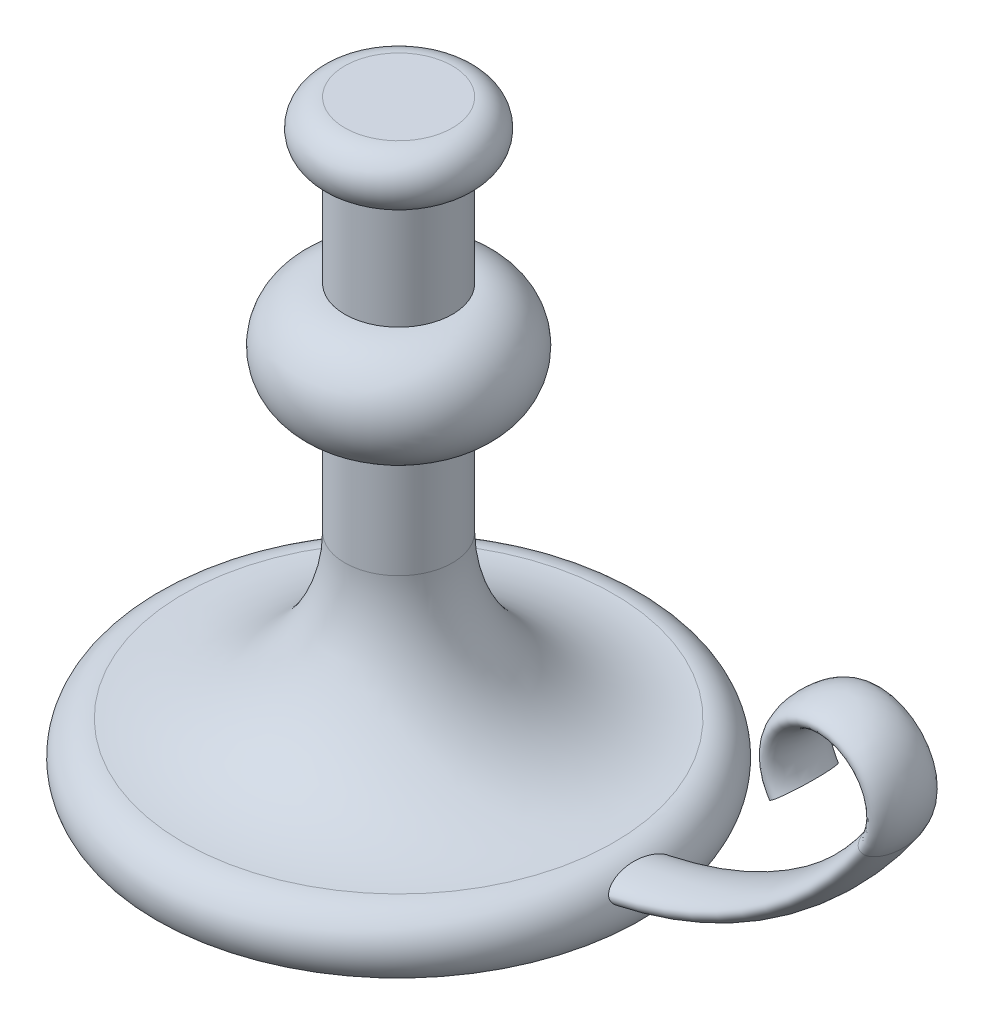
ISO-10303-21;
HEADER;
FILE_DESCRIPTION(('STEP AP214'),'2;1');
FILE_NAME('part.step','',(''),(''),'','','');
FILE_SCHEMA(('AUTOMOTIVE_DESIGN { 1 0 10303 214 1 1 1 1 }'));
ENDSEC;
DATA;
#1=APPLICATION_CONTEXT('core data for automotive mechanical design processes');
#2=APPLICATION_PROTOCOL_DEFINITION('international standard','automotive_design',2000,#1);
#3=PRODUCT_CONTEXT('',#1,'mechanical');
#4=PRODUCT('Part','Part','',(#3));
#5=PRODUCT_RELATED_PRODUCT_CATEGORY('part','',(#4));
#6=PRODUCT_DEFINITION_FORMATION('','',#4);
#7=PRODUCT_DEFINITION_CONTEXT('part definition',#1,'design');
#8=PRODUCT_DEFINITION('design','',#6,#7);
#9=PRODUCT_DEFINITION_SHAPE('','',#8);
#10=(LENGTH_UNIT() NAMED_UNIT(*) SI_UNIT(.MILLI.,.METRE.));
#11=(NAMED_UNIT(*) PLANE_ANGLE_UNIT() SI_UNIT($,.RADIAN.));
#12=(NAMED_UNIT(*) SI_UNIT($,.STERADIAN.) SOLID_ANGLE_UNIT());
#13=UNCERTAINTY_MEASURE_WITH_UNIT(LENGTH_MEASURE(1.E-05),#10,'distance_accuracy_value','');
#14=(GEOMETRIC_REPRESENTATION_CONTEXT(3) GLOBAL_UNCERTAINTY_ASSIGNED_CONTEXT((#13)) GLOBAL_UNIT_ASSIGNED_CONTEXT((#10,
#11,#12)) REPRESENTATION_CONTEXT('',''));
#15=CARTESIAN_POINT('',(0.,0.,0.));
#16=DIRECTION('',(0.,0.,1.));
#17=DIRECTION('',(1.,0.,0.));
#18=AXIS2_PLACEMENT_3D('',#15,#16,#17);
#19=CARTESIAN_POINT('',(0.,0.,0.));
#20=DIRECTION('',(0.,1.,0.));
#21=DIRECTION('',(0.,0.,1.));
#22=AXIS2_PLACEMENT_3D('',#19,#20,#21);
#23=PLANE('',#22);
#24=CARTESIAN_POINT('',(0.,0.,0.));
#25=DIRECTION('',(0.,1.,0.));
#26=DIRECTION('',(0.,0.,1.));
#27=AXIS2_PLACEMENT_3D('',#24,#25,#26);
#28=CIRCLE('',#27,90.);
#29=CARTESIAN_POINT('',(0.,0.,90.));
#30=VERTEX_POINT('',#29);
#31=EDGE_CURVE('E68',#30,#30,#28,.T.);
#32=ORIENTED_EDGE('',*,*,#31,.F.);
#33=EDGE_LOOP('',(#32));
#34=FACE_BOUND('',#33,.T.);
#35=ADVANCED_FACE('F38',(#34),#23,.F.);
#36=CARTESIAN_POINT('',(0.,220.,0.));
#37=DIRECTION('',(0.,-1.,0.));
#38=DIRECTION('',(0.,0.,-1.));
#39=AXIS2_PLACEMENT_3D('',#36,#37,#38);
#40=PLANE('',#39);
#41=CARTESIAN_POINT('',(0.,220.,0.));
#42=DIRECTION('',(0.,1.,0.));
#43=DIRECTION('',(0.,0.,1.));
#44=AXIS2_PLACEMENT_3D('',#41,#42,#43);
#45=CIRCLE('',#44,20.);
#46=CARTESIAN_POINT('',(0.,220.,20.));
#47=VERTEX_POINT('',#46);
#48=EDGE_CURVE('E10',#47,#47,#45,.T.);
#49=ORIENTED_EDGE('',*,*,#48,.T.);
#50=EDGE_LOOP('',(#49));
#51=FACE_BOUND('',#50,.T.);
#52=ADVANCED_FACE('F110',(#51),#40,.F.);
#53=CARTESIAN_POINT('',(0.,210.,0.));
#54=DIRECTION('',(0.,1.,0.));
#55=DIRECTION('',(0.,0.,1.));
#56=AXIS2_PLACEMENT_3D('',#53,#54,#55);
#57=TOROIDAL_SURFACE('',#56,20.,10.);
#58=ORIENTED_EDGE('',*,*,#48,.F.);
#59=EDGE_LOOP('',(#58));
#60=FACE_BOUND('',#59,.T.);
#61=CARTESIAN_POINT('',(0.,200.,0.));
#62=DIRECTION('',(0.,1.,0.));
#63=DIRECTION('',(0.,0.,1.));
#64=AXIS2_PLACEMENT_3D('',#61,#62,#63);
#65=CIRCLE('',#64,20.);
#66=CARTESIAN_POINT('',(0.,200.,20.));
#67=VERTEX_POINT('',#66);
#68=EDGE_CURVE('E50',#67,#67,#65,.T.);
#69=ORIENTED_EDGE('',*,*,#68,.T.);
#70=EDGE_LOOP('',(#69));
#71=FACE_BOUND('',#70,.T.);
#72=ADVANCED_FACE('F107',(#60,#71),#57,.T.);
#73=CARTESIAN_POINT('',(0.,301.66189863104,0.));
#74=DIRECTION('',(0.,1.,0.));
#75=DIRECTION('',(0.,0.,1.));
#76=AXIS2_PLACEMENT_3D('',#73,#74,#75);
#77=CYLINDRICAL_SURFACE('',#76,20.);
#78=ORIENTED_EDGE('',*,*,#68,.F.);
#79=EDGE_LOOP('',(#78));
#80=FACE_BOUND('',#79,.T.);
#81=CARTESIAN_POINT('',(0.,160.,0.));
#82=DIRECTION('',(0.,1.,0.));
#83=DIRECTION('',(0.,0.,1.));
#84=AXIS2_PLACEMENT_3D('',#81,#82,#83);
#85=CIRCLE('',#84,20.);
#86=CARTESIAN_POINT('',(0.,160.,20.));
#87=VERTEX_POINT('',#86);
#88=EDGE_CURVE('E54',#87,#87,#85,.T.);
#89=ORIENTED_EDGE('',*,*,#88,.T.);
#90=EDGE_LOOP('',(#89));
#91=FACE_BOUND('',#90,.T.);
#92=ADVANCED_FACE('F103',(#80,#91),#77,.T.);
#93=CARTESIAN_POINT('',(0.,140.,0.));
#94=DIRECTION('',(0.,1.,0.));
#95=DIRECTION('',(0.,0.,1.));
#96=AXIS2_PLACEMENT_3D('',#93,#94,#95);
#97=DEGENERATE_TOROIDAL_SURFACE('',#96,19.9999999999999,20.,.T.);
#98=ORIENTED_EDGE('',*,*,#88,.F.);
#99=EDGE_LOOP('',(#98));
#100=FACE_BOUND('',#99,.T.);
#101=CARTESIAN_POINT('',(0.,120.,0.));
#102=DIRECTION('',(0.,1.,0.));
#103=DIRECTION('',(0.,0.,1.));
#104=AXIS2_PLACEMENT_3D('',#101,#102,#103);
#105=CIRCLE('',#104,20.);
#106=CARTESIAN_POINT('',(0.,120.,20.));
#107=VERTEX_POINT('',#106);
#108=EDGE_CURVE('E59',#107,#107,#105,.T.);
#109=ORIENTED_EDGE('',*,*,#108,.T.);
#110=EDGE_LOOP('',(#109));
#111=FACE_BOUND('',#110,.T.);
#112=ADVANCED_FACE('F99',(#100,#111),#97,.T.);
#113=CARTESIAN_POINT('',(0.,301.66189863104,0.));
#114=DIRECTION('',(0.,1.,0.));
#115=DIRECTION('',(0.,0.,1.));
#116=AXIS2_PLACEMENT_3D('',#113,#114,#115);
#117=CYLINDRICAL_SURFACE('',#116,20.);
#118=ORIENTED_EDGE('',*,*,#108,.F.);
#119=EDGE_LOOP('',(#118));
#120=FACE_BOUND('',#119,.T.);
#121=CARTESIAN_POINT('',(0.,80.,0.));
#122=DIRECTION('',(0.,1.,0.));
#123=DIRECTION('',(0.,0.,1.));
#124=AXIS2_PLACEMENT_3D('',#121,#122,#123);
#125=CIRCLE('',#124,20.);
#126=CARTESIAN_POINT('',(0.,80.,20.));
#127=VERTEX_POINT('',#126);
#128=EDGE_CURVE('E62',#127,#127,#125,.T.);
#129=ORIENTED_EDGE('',*,*,#128,.T.);
#130=EDGE_LOOP('',(#129));
#131=FACE_BOUND('',#130,.T.);
#132=ADVANCED_FACE('F95',(#120,#131),#117,.T.);
#133=CARTESIAN_POINT('',(0.,80.,0.));
#134=DIRECTION('',(0.,1.,0.));
#135=DIRECTION('',(0.,0.,1.));
#136=AXIS2_PLACEMENT_3D('',#133,#134,#135);
#137=TOROIDAL_SURFACE('',#136,80.,60.);
#138=ORIENTED_EDGE('',*,*,#128,.F.);
#139=EDGE_LOOP('',(#138));
#140=FACE_BOUND('',#139,.T.);
#141=CARTESIAN_POINT('',(0.,20.,0.));
#142=DIRECTION('',(0.,1.,0.));
#143=DIRECTION('',(0.,0.,1.));
#144=AXIS2_PLACEMENT_3D('',#141,#142,#143);
#145=CIRCLE('',#144,80.0000000000002);
#146=CARTESIAN_POINT('',(0.,20.,80.0000000000002));
#147=VERTEX_POINT('',#146);
#148=EDGE_CURVE('E65',#147,#147,#145,.T.);
#149=ORIENTED_EDGE('',*,*,#148,.T.);
#150=EDGE_LOOP('',(#149));
#151=FACE_BOUND('',#150,.T.);
#152=ADVANCED_FACE('F91',(#140,#151),#137,.F.);
#153=CARTESIAN_POINT('',(0.,7.50000000000012,0.));
#154=DIRECTION('',(0.,1.,0.));
#155=DIRECTION('',(0.,0.,1.));
#156=AXIS2_PLACEMENT_3D('',#153,#154,#155);
#157=TOROIDAL_SURFACE('',#156,80.0000000000003,12.4999999999998);
#158=CARTESIAN_POINT('',(90.3650444247262,13.1056022951032,-12.1079986496694));
#159=CARTESIAN_POINT('',(90.3953344171669,13.0457657519692,-12.1079995788173));
#160=CARTESIAN_POINT('',(90.4254626602507,12.9858534342584,-12.1049478468171));
#161=CARTESIAN_POINT('',(90.4851825101059,12.8663516968071,-12.0928019828299));
#162=CARTESIAN_POINT('',(90.5147739485849,12.8067623823002,-12.0837059884374));
#163=CARTESIAN_POINT('',(90.57322301634,12.6883672231043,-12.0596890480769));
#164=CARTESIAN_POINT('',(90.6020802235625,12.6295618378862,-12.0447648290361));
#165=CARTESIAN_POINT('',(90.6588877567621,12.5131608281586,-12.0094532635097));
#166=CARTESIAN_POINT('',(90.6868378623216,12.455565498863,-11.9890646001929));
#167=CARTESIAN_POINT('',(90.7480820562558,12.3287155237725,-11.9379573212085));
#168=CARTESIAN_POINT('',(90.7811118454679,12.2598553678122,-11.9059395883533));
#169=CARTESIAN_POINT('',(90.8454973270755,12.1248557318381,-11.8352208891889));
#170=CARTESIAN_POINT('',(90.8768524900891,12.0587171136542,-11.7965178256972));
#171=CARTESIAN_POINT('',(90.9684370887323,11.8645335876216,-11.6716571479163));
#172=CARTESIAN_POINT('',(91.0261317640847,11.7408330471781,-11.5767957594499));
#173=CARTESIAN_POINT('',(91.1244088374528,11.5283714614446,-11.3906180566152));
#174=CARTESIAN_POINT('',(91.1661356204261,11.4374976407012,-11.3022092791319));
#175=CARTESIAN_POINT('',(91.2458693467372,11.2628410319498,-11.1170011632907));
#176=CARTESIAN_POINT('',(91.2838738206914,11.1790629561833,-11.0201963341931));
#177=CARTESIAN_POINT('',(91.3565997193174,11.0179359828742,-10.8199651058589));
#178=CARTESIAN_POINT('',(91.3913150643291,10.9405990218702,-10.7165270151956));
#179=CARTESIAN_POINT('',(91.457791612457,10.7918534117394,-10.5045293060962));
#180=CARTESIAN_POINT('',(91.4895516463404,10.7204471101956,-10.3959676859849));
#181=CARTESIAN_POINT('',(91.5506443575102,10.5825594446186,-10.1740598818109));
#182=CARTESIAN_POINT('',(91.5799594527219,10.5161140626667,-10.0606866395011));
#183=CARTESIAN_POINT('',(91.6362121339164,10.3881708279361,-9.83064816329137));
#184=CARTESIAN_POINT('',(91.6631500172368,10.3266723564916,-9.71398334351211));
#185=CARTESIAN_POINT('',(91.7408376909059,10.1487729935974,-9.35973365417152));
#186=CARTESIAN_POINT('',(91.7884141779778,10.0390753502167,-9.11807055089118));
#187=CARTESIAN_POINT('',(91.8767110243899,9.83452956016785,-8.62691299053791));
#188=CARTESIAN_POINT('',(91.9174182772854,9.73970982407319,-8.37740461667601));
#189=CARTESIAN_POINT('',(91.9929636571146,9.56305841174276,-7.87308702539998));
#190=CARTESIAN_POINT('',(92.0278037628512,9.48122235706377,-7.61827962788448));
#191=CARTESIAN_POINT('',(92.0837292155593,9.34943697643978,-7.17383117050763));
#192=CARTESIAN_POINT('',(92.10599254594,9.2968342482944,-6.98511262719887));
#193=CARTESIAN_POINT('',(92.1480587759864,9.19723277209145,-6.60592503585411));
#194=CARTESIAN_POINT('',(92.1678615408666,9.15023433103273,-6.41545589253651));
#195=CARTESIAN_POINT('',(92.2239133357581,9.01696496184984,-5.84160438785753));
#196=CARTESIAN_POINT('',(92.256771267833,8.93850174227734,-5.45605891308571));
#197=CARTESIAN_POINT('',(92.3146229253613,8.80000704338306,-4.68099254082324));
#198=CARTESIAN_POINT('',(92.3396133332789,8.73998333979584,-4.29147003760654));
#199=CARTESIAN_POINT('',(92.3825441024452,8.63668468503415,-3.50873674607181));
#200=CARTESIAN_POINT('',(92.400464702885,8.59345668453115,-3.11551872137659));
#201=CARTESIAN_POINT('',(92.4296584093647,8.5229570781298,-2.32763386681612));
#202=CARTESIAN_POINT('',(92.4409350060091,8.49567709357484,-1.93296790752996));
#203=CARTESIAN_POINT('',(92.4571533429001,8.45642288131329,-1.14282443002059));
#204=CARTESIAN_POINT('',(92.4620961900525,8.44444597919368,-0.747347065704524));
#205=CARTESIAN_POINT('',(92.4660013982228,8.43498499010465,0.0914159641724225));
#206=CARTESIAN_POINT('',(92.4641725547914,8.43941824943112,0.534728140301492));
#207=CARTESIAN_POINT('',(92.4526726744277,8.46726938960641,1.42078457645396));
#208=CARTESIAN_POINT('',(92.4429994233949,8.49069263041707,1.8635286407844));
#209=CARTESIAN_POINT('',(92.4154789186617,8.55721428556864,2.74762928905702));
#210=CARTESIAN_POINT('',(92.3976254777203,8.60032759278337,3.18898456768507));
#211=CARTESIAN_POINT('',(92.3531728832317,8.70739235783748,4.067761245367));
#212=CARTESIAN_POINT('',(92.3265937679934,8.77129606800371,4.50518932047296));
#213=CARTESIAN_POINT('',(92.2793960719973,8.88435497695634,5.15766844970777));
#214=CARTESIAN_POINT('',(92.2624467370552,8.92489721730413,5.37450160908864));
#215=CARTESIAN_POINT('',(92.2259185126876,9.0120956517451,5.80670673311153));
#216=CARTESIAN_POINT('',(92.2063398090096,9.05875141395259,6.02207879984212));
#217=CARTESIAN_POINT('',(92.1643537088004,9.15857098825636,6.45077860794111));
#218=CARTESIAN_POINT('',(92.1419495479037,9.21172735396666,6.66410839208792));
#219=CARTESIAN_POINT('',(92.0940156331485,9.32514898115348,7.08849895478747));
#220=CARTESIAN_POINT('',(92.0684861820624,9.38541355397956,7.29955995098452));
#221=CARTESIAN_POINT('',(92.0088476345032,9.5257563203962,7.75805387977868));
#222=CARTESIAN_POINT('',(91.9740267963342,9.60743251524525,8.00491162092463));
#223=CARTESIAN_POINT('',(91.8986918230666,9.78334343215815,8.49335896277465));
#224=CARTESIAN_POINT('',(91.8581756492878,9.87758265060666,8.73494664109807));
#225=CARTESIAN_POINT('',(91.7706020857297,10.080162756533,9.20963023167931));
#226=CARTESIAN_POINT('',(91.7235774223356,10.1884329292661,9.44276168919828));
#227=CARTESIAN_POINT('',(91.6469615571581,10.363637275861,9.78439605698211));
#228=CARTESIAN_POINT('',(91.6204199802123,10.424148856822,9.89689300609147));
#229=CARTESIAN_POINT('',(91.5650662843821,10.5498816416798,10.1186378018445));
#230=CARTESIAN_POINT('',(91.5362546798546,10.6151017784043,10.2278863768415));
#231=CARTESIAN_POINT('',(91.4835605162242,10.7338871266828,10.415741450389));
#232=CARTESIAN_POINT('',(91.4602321906687,10.7863212739676,10.4952163613179));
#233=CARTESIAN_POINT('',(91.4120070107176,10.8943429950818,10.6514777225461));
#234=CARTESIAN_POINT('',(91.3871102335156,10.9499304137054,10.7282643048663));
#235=CARTESIAN_POINT('',(91.3097420838669,11.1220254046875,10.9541771280331));
#236=CARTESIAN_POINT('',(91.2546521544413,11.2437316810257,11.0986398846702));
#237=CARTESIAN_POINT('',(91.1655460266923,11.4387050366538,11.302248235214));
#238=CARTESIAN_POINT('',(91.1345601157168,11.5062072887145,11.3682919284131));
#239=CARTESIAN_POINT('',(91.0703051272302,11.6454440996743,11.4946379847645));
#240=CARTESIAN_POINT('',(91.0370357085127,11.717179290842,11.5549394866792));
#241=CARTESIAN_POINT('',(90.9681842881204,11.864756740295,11.668381945738));
#242=CARTESIAN_POINT('',(90.9326086005183,11.9405876974583,11.721541323128));
#243=CARTESIAN_POINT('',(90.8590202289154,12.0964055336403,11.819405719182));
#244=CARTESIAN_POINT('',(90.8210090876389,12.1763897758138,11.8641160203381));
#245=CARTESIAN_POINT('',(90.7558672385255,12.3124519851983,11.9301038965668));
#246=CARTESIAN_POINT('',(90.7293941791075,12.3674874356814,11.9541971937069));
#247=CARTESIAN_POINT('',(90.675487030912,12.4789736042525,11.9975282506438));
#248=CARTESIAN_POINT('',(90.6480532346754,12.5354238900649,12.0167674740981));
#249=CARTESIAN_POINT('',(90.5923531613198,12.6494020484933,12.0499698374865));
#250=CARTESIAN_POINT('',(90.5640875590654,12.7069290344741,12.0639371340187));
#251=CARTESIAN_POINT('',(90.5068569448211,12.8227223822476,12.0862919723968));
#252=CARTESIAN_POINT('',(90.4778919199541,12.8809887576439,12.0946794114304));
#253=CARTESIAN_POINT('',(90.4193499643288,12.9980242872026,12.1056934456909));
#254=CARTESIAN_POINT('',(90.3897712121183,13.0567944949817,12.1082992799972));
#255=CARTESIAN_POINT('',(90.3303210289002,13.1741508477916,12.1076427991656));
#256=CARTESIAN_POINT('',(90.3004496042253,13.2327369967692,12.1043806107201));
#257=CARTESIAN_POINT('',(90.2406235235119,13.3492846430995,12.092101874123));
#258=CARTESIAN_POINT('',(90.2106688402273,13.4072458953822,12.0830831462952));
#259=CARTESIAN_POINT('',(90.1508824839697,13.522132053988,12.0595470605303));
#260=CARTESIAN_POINT('',(90.1210508798935,13.5790564283417,12.0450269590134));
#261=CARTESIAN_POINT('',(90.0560149799231,13.7022821170085,12.0075803012666));
#262=CARTESIAN_POINT('',(90.0208758710302,13.7682914360998,11.9835763629931));
#263=CARTESIAN_POINT('',(89.9512692953021,13.8979366829204,11.9290224531506));
#264=CARTESIAN_POINT('',(89.9168022962232,13.9615709840575,11.8984680885546));
#265=CARTESIAN_POINT('',(89.814604205069,14.1486290191413,11.7980977570117));
#266=CARTESIAN_POINT('',(89.748114798445,14.2681345250593,11.7195983150617));
#267=CARTESIAN_POINT('',(89.6333866860407,14.4708748698143,11.5646542502756));
#268=CARTESIAN_POINT('',(89.5843482154891,14.556309186604,11.4915489692098));
#269=CARTESIAN_POINT('',(89.4886502982518,14.7208496158944,11.337026833065));
#270=CARTESIAN_POINT('',(89.4419923063616,14.7999518750577,11.2556049845495));
#271=CARTESIAN_POINT('',(89.3509275782681,14.952342400007,11.0860830623767));
#272=CARTESIAN_POINT('',(89.3065249040642,15.0256203009916,10.997971605708));
#273=CARTESIAN_POINT('',(89.2198918583549,15.1667703556148,10.8164724641223));
#274=CARTESIAN_POINT('',(89.1776623466245,15.2346403754517,10.7230827211385));
#275=CARTESIAN_POINT('',(89.0963298298502,15.363721472871,10.5345785263535));
#276=CARTESIAN_POINT('',(89.0571737847018,15.425060813162,10.4395741979027));
#277=CARTESIAN_POINT('',(88.9806613053931,15.5434883575107,10.2462383689441));
#278=CARTESIAN_POINT('',(88.9433052335959,15.6005757068273,10.1479062052172));
#279=CARTESIAN_POINT('',(88.8337129879983,15.7661008034035,9.84865088895127));
#280=CARTESIAN_POINT('',(88.7639980191329,15.8687302554138,9.64357575844498));
#281=CARTESIAN_POINT('',(88.6304324348252,16.0611268129956,9.22518235667301));
#282=CARTESIAN_POINT('',(88.5665946441642,16.1508660185511,9.01184743709097));
#283=CARTESIAN_POINT('',(88.4444243628581,16.3190890735384,8.57936326694252));
#284=CARTESIAN_POINT('',(88.3860902585219,16.3975762256216,8.36021574493634));
#285=CARTESIAN_POINT('',(88.2519227876466,16.5746223463471,7.82764744990445));
#286=CARTESIAN_POINT('',(88.1785805949314,16.6684217435906,7.51202001193525));
#287=CARTESIAN_POINT('',(88.0413606563265,16.8397367568042,6.87414060895361));
#288=CARTESIAN_POINT('',(87.9774909048788,16.9172386409778,6.55188330677682));
#289=CARTESIAN_POINT('',(87.8590199499687,17.057967134407,5.90248305832664));
#290=CARTESIAN_POINT('',(87.8044221269076,17.1211885399828,5.57533837728173));
#291=CARTESIAN_POINT('',(87.7044082625477,17.2349162814632,4.91692086181997));
#292=CARTESIAN_POINT('',(87.6590072016961,17.2854019045664,4.58564221059579));
#293=CARTESIAN_POINT('',(87.5776048935869,17.3745985350374,3.92052191018861));
#294=CARTESIAN_POINT('',(87.5415993053733,17.4133149814436,3.58668151825246));
#295=CARTESIAN_POINT('',(87.4791061895073,17.4797711778855,2.91707404522573));
#296=CARTESIAN_POINT('',(87.4526178444351,17.5075118706305,2.58130713211862));
#297=CARTESIAN_POINT('',(87.3951402034084,17.5673090686814,1.68831804232272));
#298=CARTESIAN_POINT('',(87.372540809711,17.5903186980934,1.12990615056647));
#299=CARTESIAN_POINT('',(87.3542356331596,17.6089912846746,0.0120839961518292));
#300=CARTESIAN_POINT('',(87.3585371031343,17.6046468668288,-0.547326495096989));
#301=CARTESIAN_POINT('',(87.3939033025892,17.5684292654337,-1.66270467711561));
#302=CARTESIAN_POINT('',(87.4248856718045,17.5366407971321,-2.2186776649227));
#303=CARTESIAN_POINT('',(87.512929918595,17.4440879604064,-3.32592027180633));
#304=CARTESIAN_POINT('',(87.5699803779017,17.3833362778598,-3.87719184260242));
#305=CARTESIAN_POINT('',(87.6993202466225,17.2407734672704,-4.89228122925859));
#306=CARTESIAN_POINT('',(87.7681778489437,17.1633208498267,-5.35713748235291));
#307=CARTESIAN_POINT('',(87.8853430505043,17.0267643566158,-6.04854632423782));
#308=CARTESIAN_POINT('',(87.9267668872139,16.9777811846037,-6.27829741667951));
#309=CARTESIAN_POINT('',(88.014285999708,16.8723854452851,-6.73520551342333));
#310=CARTESIAN_POINT('',(88.0603813038783,16.8159728328334,-6.96236250195321));
#311=CARTESIAN_POINT('',(88.1669068956986,16.6830162244954,-7.45798529698968));
#312=CARTESIAN_POINT('',(88.2283711685039,16.6046962646467,-7.72575945700067));
#313=CARTESIAN_POINT('',(88.3584907196563,16.4345565719894,-8.25537061683916));
#314=CARTESIAN_POINT('',(88.4271491247875,16.3427309621657,-8.51720497440428));
#315=CARTESIAN_POINT('',(88.5719517937667,16.1436232819347,-9.03173594475365));
#316=CARTESIAN_POINT('',(88.6480666922015,16.0364011262264,-9.2844634355374));
#317=CARTESIAN_POINT('',(88.7686420010514,15.8614598878687,-9.6546437933089));
#318=CARTESIAN_POINT('',(88.8098848350657,15.8008193225108,-9.77650957180563));
#319=CARTESIAN_POINT('',(88.8946739457811,15.6743027305787,-10.0166566638274));
#320=CARTESIAN_POINT('',(88.9382196441416,15.6084280164382,-10.1349388657037));
#321=CARTESIAN_POINT('',(89.0164019511503,15.4883533955946,-10.3375494753595));
#322=CARTESIAN_POINT('',(89.0504859172075,15.4354482139187,-10.4228588666026));
#323=CARTESIAN_POINT('',(89.1201271832631,15.3261111718738,-10.5905737832693));
#324=CARTESIAN_POINT('',(89.1556844193265,15.2696794644903,-10.6729794344186));
#325=CARTESIAN_POINT('',(89.2284300470014,15.1528787939089,-10.8344642153458));
#326=CARTESIAN_POINT('',(89.2656211638283,15.0925031639953,-10.913537320288));
#327=CARTESIAN_POINT('',(89.3416744555685,14.96756972961,-11.0674874529981));
#328=CARTESIAN_POINT('',(89.3805366541905,14.9030118657957,-11.142364421198));
#329=CARTESIAN_POINT('',(89.460535547879,14.768512688018,-11.2879488034745));
#330=CARTESIAN_POINT('',(89.5016952002209,14.6985124268225,-11.3585895691478));
#331=CARTESIAN_POINT('',(89.5858900777333,14.5535488094372,-11.4934443824495));
#332=CARTESIAN_POINT('',(89.62892560491,14.47858465307,-11.5576573897156));
#333=CARTESIAN_POINT('',(89.7167493231271,14.323696483143,-11.6779943656169));
#334=CARTESIAN_POINT('',(89.7615327481851,14.2437856503165,-11.734138610057));
#335=CARTESIAN_POINT('',(89.8528179851754,14.0788733169035,-11.8367234792912));
#336=CARTESIAN_POINT('',(89.8993186835969,13.9938750936225,-11.8831702664509));
#337=CARTESIAN_POINT('',(89.9805967429387,13.843488642917,-11.9530998803335));
#338=CARTESIAN_POINT('',(90.0150402205992,13.7792162957571,-11.9793772541334));
#339=CARTESIAN_POINT('',(90.0844550641861,13.6485717926748,-12.0251042068496));
#340=CARTESIAN_POINT('',(90.1194262139317,13.582200485079,-12.0445565067288));
#341=CARTESIAN_POINT('',(90.1895738474772,13.4479542672364,-12.0759614803794));
#342=CARTESIAN_POINT('',(90.2247498627777,13.3800822024917,-12.0879272657268));
#343=CARTESIAN_POINT('',(90.2950369503777,13.2433742922884,-12.1039447706516));
#344=CARTESIAN_POINT('',(90.3301480309489,13.1745385807611,-12.1079975792199));
#345=CARTESIAN_POINT('',(90.3650444247262,13.1056022951032,-12.1079986496694));
#346=B_SPLINE_CURVE_WITH_KNOTS('',3,(#158,#159,#160,#161,#162,#163,#164,#165,#166,#167,#168,
#169,#170,#171,#172,#173,#174,#175,#176,#177,#178,#179,#180,#181,#182,#183,#184,#185,#186,#187,
#188,#189,#190,#191,#192,#193,#194,#195,#196,#197,#198,#199,#200,#201,#202,#203,#204,#205,#206,
#207,#208,#209,#210,#211,#212,#213,#214,#215,#216,#217,#218,#219,#220,#221,#222,#223,#224,#225,
#226,#227,#228,#229,#230,#231,#232,#233,#234,#235,#236,#237,#238,#239,#240,#241,#242,#243,#244,
#245,#246,#247,#248,#249,#250,#251,#252,#253,#254,#255,#256,#257,#258,#259,#260,#261,#262,#263,
#264,#265,#266,#267,#268,#269,#270,#271,#272,#273,#274,#275,#276,#277,#278,#279,#280,#281,#282,
#283,#284,#285,#286,#287,#288,#289,#290,#291,#292,#293,#294,#295,#296,#297,#298,#299,#300,#301,
#302,#303,#304,#305,#306,#307,#308,#309,#310,#311,#312,#313,#314,#315,#316,#317,#318,#319,#320,
#321,#322,#323,#324,#325,#326,#327,#328,#329,#330,#331,#332,#333,#334,#335,#336,#337,#338,#339,
#340,#341,#342,#343,#344,#345),.UNSPECIFIED.,.T.,.F.,(4,2,2,2,2,2,2,2,2,2,2,2,2,2,2,2,2,2,2,2,2,
2,2,2,2,2,2,2,2,2,2,2,2,2,2,2,2,2,2,2,2,2,2,2,2,2,2,2,2,2,2,2,2,2,2,2,2,2,2,2,2,2,2,2,2,2,2,2,2,
2,2,2,2,2,2,2,2,2,2,2,2,2,2,2,2,2,2,2,2,2,2,2,2,4),(0.,0.201120332346898,0.402302664217558,
0.603598140934941,0.804942169866759,1.05299053144795,1.30111684737405,1.7977639363531,
2.19768783276865,2.59787526716019,2.99878854226505,3.39985976532791,3.80360312797351,
4.20729591929676,5.01531610739935,5.82486097481205,6.63413225918094,7.22555053317948,
7.81700118978162,9.00078495964926,10.1850672346368,11.3726366322333,12.5595815509531,
13.7463190071988,15.0758571678073,16.4057707240316,17.7366918502793,19.0645776810555,
19.728215789868,20.3918070416564,21.0546451528671,21.7174191003025,22.50407182564,
23.2910068586068,24.0741197589807,24.4654066899495,24.8566052142946,25.1505942411406,
25.4445688102059,26.0332996901619,26.3312542793765,26.6292534868994,26.9264687338742,
27.2234975380301,27.4202773490641,27.6169977536232,27.8135627303366,28.0101313287768,
28.2074046424674,28.4046736970114,28.602017490541,28.7994598308452,29.0347145139048,
29.2701274662487,29.7412090373159,30.1087683233587,30.4765496114446,30.8449713803022,
31.2135378057378,31.5724016770988,31.93133749415,32.649616319441,33.3694271091965,
34.0890261888896,35.1003075920516,36.1124376864552,37.12493599925,38.1390705209991,
39.1527356529283,40.1663137020756,41.8429074507769,43.5199532508122,45.1918407221838,
46.8629965792637,48.290644209038,49.0061149730076,49.7215900847505,50.5782176324439,
51.4352190525778,52.2889716032258,52.715538989687,53.1419997522522,53.4599410465857,
53.7778685577665,54.0963481362155,54.4148322346199,54.7374456863963,55.0601112704986,
55.3819513008667,55.7035861874363,55.9358245346936,56.1679701896375,56.3997081276326,
56.6314141713999),.UNSPECIFIED.);
#347=CARTESIAN_POINT('',(90.3650444247262,13.1056022951032,-12.1079986496694));
#348=VERTEX_POINT('',#347);
#349=EDGE_CURVE('E41',#348,#348,#346,.T.);
#350=ORIENTED_EDGE('',*,*,#349,.T.);
#351=EDGE_LOOP('',(#350));
#352=FACE_BOUND('',#351,.T.);
#353=ORIENTED_EDGE('',*,*,#148,.F.);
#354=EDGE_LOOP('',(#353));
#355=FACE_BOUND('',#354,.T.);
#356=ORIENTED_EDGE('',*,*,#31,.T.);
#357=EDGE_LOOP('',(#356));
#358=FACE_BOUND('',#357,.T.);
#359=ADVANCED_FACE('F87',(#352,#355,#358),#157,.T.);
#360=CARTESIAN_POINT('',(60.,10.,0.));
#361=DIRECTION('',(1.,0.,0.));
#362=DIRECTION('',(0.,0.,-1.));
#363=AXIS2_PLACEMENT_3D('',#360,#361,#362);
#364=ELLIPSE('',#363,12.1079986496694,5.);
#365=CARTESIAN_POINT('',(60.,160.,0.));
#366=DIRECTION('',(0.,0.,1.));
#367=AXIS1_PLACEMENT('',#365,#366);
#368=SURFACE_OF_REVOLUTION('',#364,#367);
#369=CARTESIAN_POINT('',(183.592070943083,75.,0.));
#370=DIRECTION('',(0.566666666666667,0.823947139620551,0.));
#371=DIRECTION('',(0.,0.,-1.));
#372=AXIS2_PLACEMENT_3D('',#369,#370,#371);
#373=ELLIPSE('',#372,12.1079986496694,5.);
#374=CARTESIAN_POINT('',(183.592070943083,75.,-12.1079986496694));
#375=VERTEX_POINT('',#374);
#376=EDGE_CURVE('E74',#375,#375,#373,.T.);
#377=ORIENTED_EDGE('',*,*,#376,.F.);
#378=EDGE_LOOP('',(#377));
#379=FACE_BOUND('',#378,.T.);
#380=ORIENTED_EDGE('',*,*,#349,.F.);
#381=EDGE_LOOP('',(#380));
#382=FACE_BOUND('',#381,.T.);
#383=ADVANCED_FACE('F83',(#379,#382),#368,.F.);
#384=CARTESIAN_POINT('',(167.113128150672,86.3333333333333,0.));
#385=DIRECTION('',(0.,0.,1.));
#386=AXIS1_PLACEMENT('',#384,#385);
#387=SURFACE_OF_REVOLUTION('',#373,#386);
#388=ORIENTED_EDGE('',*,*,#376,.T.);
#389=EDGE_LOOP('',(#388));
#390=FACE_BOUND('',#389,.T.);
#391=CARTESIAN_POINT('',(150.634185358261,74.9999999999998,0.));
#392=DIRECTION('',(0.566666666666681,-0.823947139620542,0.));
#393=DIRECTION('',(0.,0.,-1.));
#394=AXIS2_PLACEMENT_3D('',#391,#392,#393);
#395=ELLIPSE('',#394,12.1079986496694,5.);
#396=CARTESIAN_POINT('',(150.634185358261,74.9999999999998,-12.1079986496694));
#397=VERTEX_POINT('',#396);
#398=EDGE_CURVE('E71',#397,#397,#395,.T.);
#399=ORIENTED_EDGE('',*,*,#398,.F.);
#400=EDGE_LOOP('',(#399));
#401=FACE_BOUND('',#400,.T.);
#402=ADVANCED_FACE('F80',(#390,#401),#387,.F.);
#403=CARTESIAN_POINT('',(150.634185358261,74.9999999999998,0.));
#404=DIRECTION('',(0.566666666666681,-0.823947139620542,0.));
#405=DIRECTION('',(0.,0.,-1.));
#406=AXIS2_PLACEMENT_3D('',#403,#404,#405);
#407=PLANE('',#406);
#408=ORIENTED_EDGE('',*,*,#398,.T.);
#409=EDGE_LOOP('',(#408));
#410=FACE_BOUND('',#409,.T.);
#411=ADVANCED_FACE('F82',(#410),#407,.T.);
#412=CLOSED_SHELL('',(#35,#52,#72,#92,#112,#132,#152,#359,#383,#402,#411));
#413=MANIFOLD_SOLID_BREP('B2',#412);
#414=ADVANCED_BREP_SHAPE_REPRESENTATION('',(#18,#413),#14);
#415=SHAPE_DEFINITION_REPRESENTATION(#9,#414);
ENDSEC;
END-ISO-10303-21;
